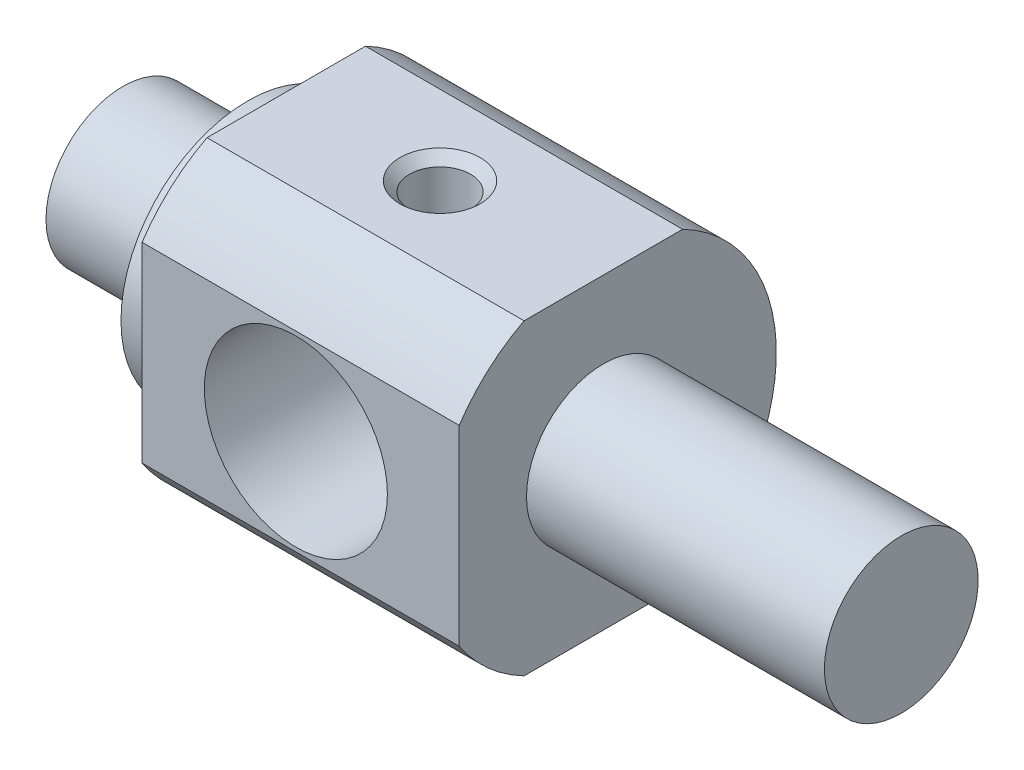
ISO-10303-21;
HEADER;
FILE_DESCRIPTION(('STEP AP214'),'2;1');
FILE_NAME('part.step','',(''),(''),'','','');
FILE_SCHEMA(('AUTOMOTIVE_DESIGN { 1 0 10303 214 1 1 1 1 }'));
ENDSEC;
DATA;
#1=APPLICATION_CONTEXT('core data for automotive mechanical design processes');
#2=APPLICATION_PROTOCOL_DEFINITION('international standard','automotive_design',2000,#1);
#3=PRODUCT_CONTEXT('',#1,'mechanical');
#4=PRODUCT('Part','Part','',(#3));
#5=PRODUCT_RELATED_PRODUCT_CATEGORY('part','',(#4));
#6=PRODUCT_DEFINITION_FORMATION('','',#4);
#7=PRODUCT_DEFINITION_CONTEXT('part definition',#1,'design');
#8=PRODUCT_DEFINITION('design','',#6,#7);
#9=PRODUCT_DEFINITION_SHAPE('','',#8);
#10=(LENGTH_UNIT() NAMED_UNIT(*) SI_UNIT(.MILLI.,.METRE.));
#11=(NAMED_UNIT(*) PLANE_ANGLE_UNIT() SI_UNIT($,.RADIAN.));
#12=(NAMED_UNIT(*) SI_UNIT($,.STERADIAN.) SOLID_ANGLE_UNIT());
#13=UNCERTAINTY_MEASURE_WITH_UNIT(LENGTH_MEASURE(1.E-05),#10,'distance_accuracy_value','');
#14=(GEOMETRIC_REPRESENTATION_CONTEXT(3) GLOBAL_UNCERTAINTY_ASSIGNED_CONTEXT((#13)) GLOBAL_UNIT_ASSIGNED_CONTEXT((#10,
#11,#12)) REPRESENTATION_CONTEXT('',''));
#15=CARTESIAN_POINT('',(0.,0.,0.));
#16=DIRECTION('',(0.,0.,1.));
#17=DIRECTION('',(1.,0.,0.));
#18=AXIS2_PLACEMENT_3D('',#15,#16,#17);
#19=CARTESIAN_POINT('',(-8.,0.,-0.75));
#20=DIRECTION('',(-1.,0.,0.));
#21=DIRECTION('',(0.,0.,1.));
#22=AXIS2_PLACEMENT_3D('',#19,#20,#21);
#23=PLANE('',#22);
#24=CARTESIAN_POINT('',(-8.,0.,0.));
#25=DIRECTION('',(-1.,0.,0.));
#26=DIRECTION('',(0.,0.,1.));
#27=AXIS2_PLACEMENT_3D('',#24,#25,#26);
#28=CIRCLE('',#27,6.6);
#29=CARTESIAN_POINT('',(-8.,0.,6.6));
#30=VERTEX_POINT('',#29);
#31=EDGE_CURVE('E262',#30,#30,#28,.T.);
#32=ORIENTED_EDGE('',*,*,#31,.F.);
#33=EDGE_LOOP('',(#32));
#34=FACE_BOUND('',#33,.T.);
#35=CARTESIAN_POINT('',(-8.,0.,0.));
#36=DIRECTION('',(-1.,0.,0.));
#37=DIRECTION('',(0.,0.,1.));
#38=AXIS2_PLACEMENT_3D('',#35,#36,#37);
#39=CIRCLE('',#38,9.);
#40=CARTESIAN_POINT('',(-8.,8.,-4.12310562561766));
#41=VERTEX_POINT('',#40);
#42=CARTESIAN_POINT('',(-8.,-8.,-4.12310562561766));
#43=VERTEX_POINT('',#42);
#44=EDGE_CURVE('E234',#41,#43,#39,.T.);
#45=ORIENTED_EDGE('',*,*,#44,.T.);
#46=DIRECTION('',(0.,0.,1.));
#47=VECTOR('',#46,1.);
#48=CARTESIAN_POINT('',(-8.,-8.,-0.75));
#49=LINE('',#48,#47);
#50=CARTESIAN_POINT('',(-8.,-8.,4.12310562561766));
#51=VERTEX_POINT('',#50);
#52=EDGE_CURVE('E59',#43,#51,#49,.T.);
#53=ORIENTED_EDGE('',*,*,#52,.T.);
#54=CARTESIAN_POINT('',(-8.,-4.9749371855331,7.5));
#55=VERTEX_POINT('',#54);
#56=EDGE_CURVE('E236',#51,#55,#39,.T.);
#57=ORIENTED_EDGE('',*,*,#56,.T.);
#58=DIRECTION('',(0.,-1.,0.));
#59=VECTOR('',#58,1.);
#60=CARTESIAN_POINT('',(-8.,0.,7.5));
#61=LINE('',#60,#59);
#62=CARTESIAN_POINT('',(-8.,4.9749371855331,7.5));
#63=VERTEX_POINT('',#62);
#64=EDGE_CURVE('E130',#63,#55,#61,.T.);
#65=ORIENTED_EDGE('',*,*,#64,.F.);
#66=CARTESIAN_POINT('',(-8.,8.,4.12310562561766));
#67=VERTEX_POINT('',#66);
#68=EDGE_CURVE('E229',#63,#67,#39,.T.);
#69=ORIENTED_EDGE('',*,*,#68,.T.);
#70=DIRECTION('',(0.,0.,-1.));
#71=VECTOR('',#70,1.);
#72=CARTESIAN_POINT('',(-8.,8.,-0.75));
#73=LINE('',#72,#71);
#74=EDGE_CURVE('E67',#67,#41,#73,.T.);
#75=ORIENTED_EDGE('',*,*,#74,.T.);
#76=EDGE_LOOP('',(#45,#53,#57,#65,#69,#75));
#77=FACE_BOUND('',#76,.T.);
#78=ADVANCED_FACE('F43',(#34,#77),#23,.T.);
#79=CARTESIAN_POINT('',(8.5,0.,-4.));
#80=DIRECTION('',(-1.,0.,0.));
#81=DIRECTION('',(0.,0.,1.));
#82=AXIS2_PLACEMENT_3D('',#79,#80,#81);
#83=PLANE('',#82);
#84=CARTESIAN_POINT('',(8.5,0.,0.));
#85=DIRECTION('',(-1.,0.,0.));
#86=DIRECTION('',(0.,0.,1.));
#87=AXIS2_PLACEMENT_3D('',#84,#85,#86);
#88=CIRCLE('',#87,4.);
#89=CARTESIAN_POINT('',(8.5,0.,4.));
#90=VERTEX_POINT('',#89);
#91=EDGE_CURVE('E120',#90,#90,#88,.T.);
#92=ORIENTED_EDGE('',*,*,#91,.T.);
#93=EDGE_LOOP('',(#92));
#94=FACE_BOUND('',#93,.T.);
#95=DIRECTION('',(0.,0.,1.));
#96=VECTOR('',#95,1.);
#97=CARTESIAN_POINT('',(8.5,-8.,-4.));
#98=LINE('',#97,#96);
#99=CARTESIAN_POINT('',(8.5,-8.,-4.12310562561766));
#100=VERTEX_POINT('',#99);
#101=CARTESIAN_POINT('',(8.5,-8.,4.12310562561766));
#102=VERTEX_POINT('',#101);
#103=EDGE_CURVE('E97',#100,#102,#98,.T.);
#104=ORIENTED_EDGE('',*,*,#103,.F.);
#105=CARTESIAN_POINT('',(8.5,0.,0.));
#106=DIRECTION('',(-1.,0.,0.));
#107=DIRECTION('',(0.,0.,1.));
#108=AXIS2_PLACEMENT_3D('',#105,#106,#107);
#109=CIRCLE('',#108,9.);
#110=CARTESIAN_POINT('',(8.5,8.,-4.12310562561766));
#111=VERTEX_POINT('',#110);
#112=EDGE_CURVE('E110',#111,#100,#109,.T.);
#113=ORIENTED_EDGE('',*,*,#112,.F.);
#114=DIRECTION('',(0.,0.,-1.));
#115=VECTOR('',#114,1.);
#116=CARTESIAN_POINT('',(8.5,8.,-4.));
#117=LINE('',#116,#115);
#118=CARTESIAN_POINT('',(8.5,8.,4.12310562561766));
#119=VERTEX_POINT('',#118);
#120=EDGE_CURVE('E287',#119,#111,#117,.T.);
#121=ORIENTED_EDGE('',*,*,#120,.F.);
#122=CARTESIAN_POINT('',(8.5,4.9749371855331,7.5));
#123=VERTEX_POINT('',#122);
#124=EDGE_CURVE('E117',#123,#119,#109,.T.);
#125=ORIENTED_EDGE('',*,*,#124,.F.);
#126=DIRECTION('',(0.,1.,0.));
#127=VECTOR('',#126,1.);
#128=CARTESIAN_POINT('',(8.5,0.,7.5));
#129=LINE('',#128,#127);
#130=CARTESIAN_POINT('',(8.5,-4.9749371855331,7.5));
#131=VERTEX_POINT('',#130);
#132=EDGE_CURVE('E241',#131,#123,#129,.T.);
#133=ORIENTED_EDGE('',*,*,#132,.F.);
#134=EDGE_CURVE('E112',#102,#131,#109,.T.);
#135=ORIENTED_EDGE('',*,*,#134,.F.);
#136=EDGE_LOOP('',(#104,#113,#121,#125,#133,#135));
#137=FACE_BOUND('',#136,.T.);
#138=ADVANCED_FACE('F108',(#94,#137),#83,.F.);
#139=CARTESIAN_POINT('',(-16.5,0.,0.));
#140=DIRECTION('',(-1.,0.,0.));
#141=DIRECTION('',(0.,0.,1.));
#142=AXIS2_PLACEMENT_3D('',#139,#140,#141);
#143=CYLINDRICAL_SURFACE('',#142,9.);
#144=DIRECTION('',(-1.,0.,0.));
#145=VECTOR('',#144,1.);
#146=CARTESIAN_POINT('',(-16.5,-8.,4.12310562561766));
#147=LINE('',#146,#145);
#148=EDGE_CURVE('E178',#102,#51,#147,.T.);
#149=ORIENTED_EDGE('',*,*,#148,.F.);
#150=ORIENTED_EDGE('',*,*,#134,.T.);
#151=DIRECTION('',(-1.,0.,0.));
#152=VECTOR('',#151,1.);
#153=CARTESIAN_POINT('',(-16.5,-4.9749371855331,7.5));
#154=LINE('',#153,#152);
#155=EDGE_CURVE('E231',#55,#131,#154,.F.);
#156=ORIENTED_EDGE('',*,*,#155,.F.);
#157=ORIENTED_EDGE('',*,*,#56,.F.);
#158=EDGE_LOOP('',(#149,#150,#156,#157));
#159=FACE_BOUND('',#158,.T.);
#160=ADVANCED_FACE('F205',(#159),#143,.T.);
#161=CARTESIAN_POINT('',(4.7625,0.,-9.));
#162=CARTESIAN_POINT('',(4.76250040344034,0.124347530609337,-9.00000033593268));
#163=CARTESIAN_POINT('',(4.75762497102388,0.248690209153137,-8.99741747917679));
#164=CARTESIAN_POINT('',(4.73818429685444,0.496448267490568,-8.98715281459778));
#165=CARTESIAN_POINT('',(4.72361561012522,0.619863301824312,-8.97946919396871));
#166=CARTESIAN_POINT('',(4.68494604518612,0.864923756681962,-8.95918759669115));
#167=CARTESIAN_POINT('',(4.66083414342587,0.98656696145733,-8.9465839370429));
#168=CARTESIAN_POINT('',(4.60335659926926,1.2271165949106,-8.91677535279601));
#169=CARTESIAN_POINT('',(4.56998717551858,1.34602188371177,-8.89956854808615));
#170=CARTESIAN_POINT('',(4.49453183223207,1.57974647578819,-8.86105868833504));
#171=CARTESIAN_POINT('',(4.45248572241949,1.69458172797125,-8.8397743723139));
#172=CARTESIAN_POINT('',(4.35999791893359,1.9200769121018,-8.79355324714562));
#173=CARTESIAN_POINT('',(4.30955305630161,2.03073524863851,-8.76861505977304));
#174=CARTESIAN_POINT('',(4.14631195388206,2.355441383801,-8.689154350124));
#175=CARTESIAN_POINT('',(4.02153101438027,2.56245973522728,-8.62994450585192));
#176=CARTESIAN_POINT('',(3.73450769966515,2.96653161712556,-8.49986717483721));
#177=CARTESIAN_POINT('',(3.57034891314541,3.16204774981258,-8.42849050207323));
#178=CARTESIAN_POINT('',(3.21341021284217,3.52422455016379,-8.28359383226396));
#179=CARTESIAN_POINT('',(3.02060591709596,3.69086037164852,-8.21007205265056));
#180=CARTESIAN_POINT('',(2.59104583087089,4.00559873450946,-8.06152102346557));
#181=CARTESIAN_POINT('',(2.35190146425856,4.15071118989951,-7.98694495512679));
#182=CARTESIAN_POINT('',(1.97456817015392,4.33614928006894,-7.88687285646168));
#183=CARTESIAN_POINT('',(1.84564222134866,4.39260344965641,-7.85547245236333));
#184=CARTESIAN_POINT('',(1.5823191366162,4.49416795346155,-7.79781135767696));
#185=CARTESIAN_POINT('',(1.44792547419633,4.5392853628367,-7.77154746372517));
#186=CARTESIAN_POINT('',(1.1830798050455,4.61514045974754,-7.72672647724666));
#187=CARTESIAN_POINT('',(1.05289599580195,4.64659346275591,-7.70779393806304));
#188=CARTESIAN_POINT('',(0.789657110491455,4.69849204058019,-7.67626849509927));
#189=CARTESIAN_POINT('',(0.65660369525027,4.71894381365446,-7.66367202174455));
#190=CARTESIAN_POINT('',(0.388873670643937,4.74850579482423,-7.64539058531394));
#191=CARTESIAN_POINT('',(0.254198429728474,4.75762496903582,-7.63970015840158));
#192=CARTESIAN_POINT('',(-0.0155431786148998,4.76438472807634,-7.63548662756686));
#193=CARTESIAN_POINT('',(-0.1506094981826,4.76202666269402,-7.63696268082556));
#194=CARTESIAN_POINT('',(-0.401152716936114,4.7469969845373,-7.64631160227324));
#195=CARTESIAN_POINT('',(-0.516754986564765,4.73579711408422,-7.65327138720916));
#196=CARTESIAN_POINT('',(-0.746443468906819,4.70506908950683,-7.67219908924904));
#197=CARTESIAN_POINT('',(-0.860529202601121,4.68553836552996,-7.68416855168734));
#198=CARTESIAN_POINT('',(-1.19933778505102,4.61477120774495,-7.72703163704495));
#199=CARTESIAN_POINT('',(-1.42076628999166,4.55135015439165,-7.76488652808671));
#200=CARTESIAN_POINT('',(-1.85436132832839,4.39287685995124,-7.85563852081105));
#201=CARTESIAN_POINT('',(-2.06620473013008,4.29714108141298,-7.9088567355142));
#202=CARTESIAN_POINT('',(-2.47192313766677,4.0772854937053,-8.02440970702211));
#203=CARTESIAN_POINT('',(-2.66579009227439,3.95315305196382,-8.08674851676314));
#204=CARTESIAN_POINT('',(-3.05943768140512,3.65923791181625,-8.22435127572942));
#205=CARTESIAN_POINT('',(-3.25603446809802,3.48545254953575,-8.30018223292903));
#206=CARTESIAN_POINT('',(-3.61878837512707,3.10715207855429,-8.44907339742118));
#207=CARTESIAN_POINT('',(-3.78492745789656,2.90261889011612,-8.52213194266733));
#208=CARTESIAN_POINT('',(-4.01229420738898,2.56951895440973,-8.62625299951984));
#209=CARTESIAN_POINT('',(-4.08610651228028,2.45048287630086,-8.66090273193149));
#210=CARTESIAN_POINT('',(-4.2233184790146,2.20559716317462,-8.72647541123955));
#211=CARTESIAN_POINT('',(-4.28672257017004,2.07975045695929,-8.75739994193113));
#212=CARTESIAN_POINT('',(-4.4024166722361,1.82210605452825,-8.81460949891191));
#213=CARTESIAN_POINT('',(-4.45471182057732,1.69031114345429,-8.84089666883255));
#214=CARTESIAN_POINT('',(-4.54756346992604,1.4217082325301,-8.88804394832803));
#215=CARTESIAN_POINT('',(-4.58812150455471,1.28490089025961,-8.90890476689695));
#216=CARTESIAN_POINT('',(-4.65385418760969,1.01980548149451,-8.94294338288788));
#217=CARTESIAN_POINT('',(-4.68007688556574,0.891843215793048,-8.9566398222332));
#218=CARTESIAN_POINT('',(-4.72195515273394,0.633744720642586,-8.97859314111829));
#219=CARTESIAN_POINT('',(-4.73761181149047,0.503608716762799,-8.98685058151237));
#220=CARTESIAN_POINT('',(-4.75813604512215,0.242311954478257,-8.99768728747259));
#221=CARTESIAN_POINT('',(-4.76300848266171,0.111151684704635,-9.00026911220135));
#222=CARTESIAN_POINT('',(-4.76190771489409,-0.15110703256956,-8.99968654248137));
#223=CARTESIAN_POINT('',(-4.75593511011223,-0.282205483091189,-8.99652246620188));
#224=CARTESIAN_POINT('',(-4.73424855064391,-0.531535942882391,-8.98507811945353));
#225=CARTESIAN_POINT('',(-4.71945222443262,-0.649871386958457,-8.97728000824626));
#226=CARTESIAN_POINT('',(-4.68110736184933,-0.884763575078478,-8.95718110814576));
#227=CARTESIAN_POINT('',(-4.65755608471691,-1.00131975020947,-8.9448789092543));
#228=CARTESIAN_POINT('',(-4.60196425659837,-1.23181886042372,-8.91605869083801));
#229=CARTESIAN_POINT('',(-4.56992636841199,-1.34576260303282,-8.89954199373392));
#230=CARTESIAN_POINT('',(-4.49768482213555,-1.57040822753636,-8.86266360437937));
#231=CARTESIAN_POINT('',(-4.45747801634521,-1.68110884089638,-8.84230043019264));
#232=CARTESIAN_POINT('',(-4.32291680123585,-2.01285493333985,-8.77496475562326));
#233=CARTESIAN_POINT('',(-4.21600277364841,-2.22784676260846,-8.72248545363852));
#234=CARTESIAN_POINT('',(-3.97273258849654,-2.63736014731493,-8.60753941243389));
#235=CARTESIAN_POINT('',(-3.83636477814371,-2.83187355544841,-8.54506872287111));
#236=CARTESIAN_POINT('',(-3.52137960502942,-3.21708140633032,-8.40811866059607));
#237=CARTESIAN_POINT('',(-3.33980863724168,-3.40516035248391,-8.33306899481405));
#238=CARTESIAN_POINT('',(-2.94791523306578,-3.74956909780719,-8.18388734030329));
#239=CARTESIAN_POINT('',(-2.73756728995106,-3.90587042157548,-8.10975623003755));
#240=CARTESIAN_POINT('',(-2.39626688930486,-4.11811375214691,-8.00299868949882));
#241=CARTESIAN_POINT('',(-2.27410215022463,-4.18683953100871,-7.96715458296367));
#242=CARTESIAN_POINT('',(-2.02336685114954,-4.31359488157598,-7.89924434073457));
#243=CARTESIAN_POINT('',(-1.8947994215147,-4.37162961630491,-7.86717638413926));
#244=CARTESIAN_POINT('',(-1.6321305650715,-4.47633002878034,-7.80807832339694));
#245=CARTESIAN_POINT('',(-1.49803418007951,-4.52300580779348,-7.7810437482403));
#246=CARTESIAN_POINT('',(-1.22518750903089,-4.6044083186877,-7.73315334237041));
#247=CARTESIAN_POINT('',(-1.08643804422795,-4.6391371471125,-7.71229642764267));
#248=CARTESIAN_POINT('',(-0.819273916993452,-4.69328392273565,-7.67945226514975));
#249=CARTESIAN_POINT('',(-0.691177302945137,-4.71386794672929,-7.66679657998025));
#250=CARTESIAN_POINT('',(-0.433271103101365,-4.74452730742417,-7.64786173290068));
#251=CARTESIAN_POINT('',(-0.303461750092644,-4.75460405762069,-7.64158171330458));
#252=CARTESIAN_POINT('',(-0.0433694510382342,-4.76407931361045,-7.63567808280728));
#253=CARTESIAN_POINT('',(0.0869132157401269,-4.76348333250254,-7.63605103525096));
#254=CARTESIAN_POINT('',(0.34679655585983,-4.75163730961809,-7.64342798657303));
#255=CARTESIAN_POINT('',(0.476397271138804,-4.74038793087339,-7.65043157278294));
#256=CARTESIAN_POINT('',(0.718496074448173,-4.70937876393872,-7.66955263472613));
#257=CARTESIAN_POINT('',(0.83120151623908,-4.69078495106566,-7.6809660561983));
#258=CARTESIAN_POINT('',(1.05447229830989,-4.64569507486617,-7.70832050051003));
#259=CARTESIAN_POINT('',(1.16503697948606,-4.61919661777295,-7.72426289479052));
#260=CARTESIAN_POINT('',(1.49251447862105,-4.52825029307427,-7.77817276738403));
#261=CARTESIAN_POINT('',(1.70535271444985,-4.45233287959253,-7.82223512012185));
#262=CARTESIAN_POINT('',(2.12915698663366,-4.26674886059048,-7.92507095583544));
#263=CARTESIAN_POINT('',(2.33910172027825,-4.15520901106104,-7.98461461078299));
#264=CARTESIAN_POINT('',(2.73873560413043,-3.9034008640743,-8.11068926544477));
#265=CARTESIAN_POINT('',(2.92841376260295,-3.76311709625537,-8.17722401842726));
#266=CARTESIAN_POINT('',(3.3100914927705,-3.43464615735664,-8.32104145757807));
#267=CARTESIAN_POINT('',(3.49861356527532,-3.24248814667078,-8.3985115102675));
#268=CARTESIAN_POINT('',(3.84182536349103,-2.82740321822199,-8.54717875720498));
#269=CARTESIAN_POINT('',(3.99649372834455,-2.60445701771309,-8.61837197410443));
#270=CARTESIAN_POINT('',(4.20079827858228,-2.24812566848557,-8.71559793731253));
#271=CARTESIAN_POINT('',(4.26483700274428,-2.12418324985102,-8.74670425907457));
#272=CARTESIAN_POINT('',(4.38210340700569,-1.87031879401267,-8.80447671148234));
#273=CARTESIAN_POINT('',(4.43533641009264,-1.74039973982838,-8.83114502715428));
#274=CARTESIAN_POINT('',(4.53025646437553,-1.47577336946772,-8.87919744770186));
#275=CARTESIAN_POINT('',(4.57196701465996,-1.34107644039356,-8.90059229762171));
#276=CARTESIAN_POINT('',(4.64339305083211,-1.06781622605154,-8.93749157200341));
#277=CARTESIAN_POINT('',(4.673115276126,-0.92925516003718,-8.95299930570159));
#278=CARTESIAN_POINT('',(4.71847947813409,-0.659351879404655,-8.97676434810901));
#279=CARTESIAN_POINT('',(4.73496634992829,-0.528189374616844,-8.98545571626096));
#280=CARTESIAN_POINT('',(4.75697648476616,-0.26468276068211,-8.99707341002876));
#281=CARTESIAN_POINT('',(4.76249957063286,-0.132338632474631,-8.99999964247885));
#282=CARTESIAN_POINT('',(4.7625,0.,-9.));
#283=B_SPLINE_CURVE_WITH_KNOTS('',3,(#161,#162,#163,#164,#165,#166,#167,#168,#169,#170,#171,
#172,#173,#174,#175,#176,#177,#178,#179,#180,#181,#182,#183,#184,#185,#186,#187,#188,#189,#190,
#191,#192,#193,#194,#195,#196,#197,#198,#199,#200,#201,#202,#203,#204,#205,#206,#207,#208,#209,
#210,#211,#212,#213,#214,#215,#216,#217,#218,#219,#220,#221,#222,#223,#224,#225,#226,#227,#228,
#229,#230,#231,#232,#233,#234,#235,#236,#237,#238,#239,#240,#241,#242,#243,#244,#245,#246,#247,
#248,#249,#250,#251,#252,#253,#254,#255,#256,#257,#258,#259,#260,#261,#262,#263,#264,#265,#266,
#267,#268,#269,#270,#271,#272,#273,#274,#275,#276,#277,#278,#279,#280,#281,#282),.UNSPECIFIED.,
.T.,.F.,(4,2,2,2,2,2,2,2,2,2,2,2,2,2,2,2,2,2,2,2,2,2,2,2,2,2,2,2,2,2,2,2,2,2,2,2,2,2,2,2,2,2,2,
2,2,2,2,2,2,2,2,2,2,2,2,2,2,2,2,2,4),(0.,0.372912735375715,0.745958074537272,1.11943558906099,
1.49306588047298,1.86501857493255,2.23711193135867,2.98054173945517,3.77259683168748,
4.56532999470477,5.42895642000663,5.86105348503776,6.29288020910701,6.69807088525076,
7.10303303112271,7.50767457497925,7.91226853183547,8.26089695162553,8.60963299211596,
9.30664673976379,10.0194388201854,10.7325486128775,11.5485658366515,12.365064769404,
12.7974337802674,13.2296183127742,13.6616025404303,14.0935302976789,14.4870065185386,
14.8804421588801,15.2737003607644,15.666936787325,16.0250536553686,16.3832827273805,
16.7413995325868,17.0996545922854,17.8336908431551,18.5680180341853,19.3805925575267,
20.1938920370063,20.6274443207353,21.0607866771151,21.4937422519301,21.9266218095311,
22.3171226184695,22.7075708883476,23.097817474352,23.4880397743099,23.8320373095211,
24.1761391235887,24.8639166558257,25.5964082992801,26.3292952200101,27.1660025255825,
28.0032362606288,28.431539090943,28.8596304209725,29.2868421381476,29.7138133563692,
30.1106846387448,30.5075623345878),.UNSPECIFIED.);
#284=CARTESIAN_POINT('',(4.7625,0.,-9.));
#285=VERTEX_POINT('',#284);
#286=EDGE_CURVE('E142',#285,#285,#283,.T.);
#287=ORIENTED_EDGE('',*,*,#286,.T.);
#288=EDGE_LOOP('',(#287));
#289=FACE_BOUND('',#288,.T.);
#290=DIRECTION('',(-1.,0.,0.));
#291=VECTOR('',#290,1.);
#292=CARTESIAN_POINT('',(-16.5,-8.,-4.12310562561766));
#293=LINE('',#292,#291);
#294=EDGE_CURVE('E94',#43,#100,#293,.F.);
#295=ORIENTED_EDGE('',*,*,#294,.F.);
#296=ORIENTED_EDGE('',*,*,#44,.F.);
#297=DIRECTION('',(-1.,0.,0.));
#298=VECTOR('',#297,1.);
#299=CARTESIAN_POINT('',(-16.5,8.,-4.12310562561766));
#300=LINE('',#299,#298);
#301=EDGE_CURVE('E116',#111,#41,#300,.T.);
#302=ORIENTED_EDGE('',*,*,#301,.F.);
#303=ORIENTED_EDGE('',*,*,#112,.T.);
#304=EDGE_LOOP('',(#295,#296,#302,#303));
#305=FACE_BOUND('',#304,.T.);
#306=ADVANCED_FACE('F115',(#289,#305),#143,.T.);
#307=CARTESIAN_POINT('',(0.,8.,0.));
#308=DIRECTION('',(0.,1.,0.));
#309=DIRECTION('',(0.,0.,1.));
#310=AXIS2_PLACEMENT_3D('',#307,#308,#309);
#311=CYLINDRICAL_SURFACE('',#310,1.5875);
#312=CARTESIAN_POINT('',(0.,-4.7625,1.5875));
#313=CARTESIAN_POINT('',(-0.0866193385826729,-4.76250024290248,1.58750040279898));
#314=CARTESIAN_POINT('',(-0.173236246329948,-4.76011509093227,1.58038757752304));
#315=CARTESIAN_POINT('',(-0.343918795385843,-4.75083521197708,1.55221128975266));
#316=CARTESIAN_POINT('',(-0.427984170888622,-4.74394001683417,1.53114637898108));
#317=CARTESIAN_POINT('',(-0.591078303334068,-4.72638926301477,1.47586820112782));
#318=CARTESIAN_POINT('',(-0.670115223594078,-4.71573999272729,1.4416769133459));
#319=CARTESIAN_POINT('',(-0.821332712178451,-4.6917680757628,1.36121588811912));
#320=CARTESIAN_POINT('',(-0.893511924171944,-4.67844490185097,1.31494376805837));
#321=CARTESIAN_POINT('',(-1.03146490909785,-4.6500112492827,1.20995153478673));
#322=CARTESIAN_POINT('',(-1.09696837422356,-4.63485795886258,1.15088791561146));
#323=CARTESIAN_POINT('',(-1.21734689966456,-4.60470749718205,1.02271964190332));
#324=CARTESIAN_POINT('',(-1.27221961946452,-4.58971036098746,0.953612782050985));
#325=CARTESIAN_POINT('',(-1.37132209578672,-4.56109915307672,0.804886129625619));
#326=CARTESIAN_POINT('',(-1.41520046242589,-4.54753724850155,0.725021188175255));
#327=CARTESIAN_POINT('',(-1.48878746228088,-4.52398297352029,0.558520450047056));
#328=CARTESIAN_POINT('',(-1.51850041960149,-4.51398951405183,0.471886729004144));
#329=CARTESIAN_POINT('',(-1.56189912014579,-4.49915443940136,0.297381260873972));
#330=CARTESIAN_POINT('',(-1.57609134913143,-4.49415052034258,0.20964968152361));
#331=CARTESIAN_POINT('',(-1.58962903329348,-4.48938104899343,0.0329187902775394));
#332=CARTESIAN_POINT('',(-1.58897907629749,-4.48961387798584,-0.0560801213758395));
#333=CARTESIAN_POINT('',(-1.57324409712917,-4.49514936325486,-0.228499400829883));
#334=CARTESIAN_POINT('',(-1.5588200871526,-4.50021985189708,-0.311988839633941));
#335=CARTESIAN_POINT('',(-1.51702478352345,-4.51447944137724,-0.475287053625849));
#336=CARTESIAN_POINT('',(-1.48965193971459,-4.52366903532271,-0.555095386878173));
#337=CARTESIAN_POINT('',(-1.42230325467058,-4.54529683920857,-0.710267739976471));
#338=CARTESIAN_POINT('',(-1.38213155232278,-4.55778498196574,-0.785539490432871));
#339=CARTESIAN_POINT('',(-1.29046145625623,-4.58458186738965,-0.928482566894064));
#340=CARTESIAN_POINT('',(-1.23895979087786,-4.59889113542361,-0.996151689006741));
#341=CARTESIAN_POINT('',(-1.12291706563305,-4.62863135053788,-1.12568291208022));
#342=CARTESIAN_POINT('',(-1.05783562574614,-4.64408185600813,-1.18705740253315));
#343=CARTESIAN_POINT('',(-0.918114067327474,-4.67371014689421,-1.29814838582814));
#344=CARTESIAN_POINT('',(-0.843473033111541,-4.68788781016682,-1.34786376058613));
#345=CARTESIAN_POINT('',(-0.685716835710948,-4.71355908851247,-1.43461787662317));
#346=CARTESIAN_POINT('',(-0.602524951310933,-4.72502468137762,-1.47152596750341));
#347=CARTESIAN_POINT('',(-0.430639669841155,-4.7437765034179,-1.53067253865469));
#348=CARTESIAN_POINT('',(-0.341948195570988,-4.7510641842712,-1.5529161147347));
#349=CARTESIAN_POINT('',(-0.16570932937777,-4.76039857975911,-1.58123836981049));
#350=CARTESIAN_POINT('',(-0.078278989785443,-4.76265877911043,-1.58797594706174));
#351=CARTESIAN_POINT('',(0.0964804235618768,-4.76232383028038,-1.58697188066243));
#352=CARTESIAN_POINT('',(0.183809511919945,-4.75972950165737,-1.57923268103194));
#353=CARTESIAN_POINT('',(0.353250287758005,-4.75011789238403,-1.55001609646916));
#354=CARTESIAN_POINT('',(0.435439830850313,-4.74323090454018,-1.52894314789643));
#355=CARTESIAN_POINT('',(0.595083834245072,-4.72585806842736,-1.47416290690907));
#356=CARTESIAN_POINT('',(0.672537689257411,-4.71537176124096,-1.44045400334489));
#357=CARTESIAN_POINT('',(0.82278267052432,-4.69152178418572,-1.36037568945275));
#358=CARTESIAN_POINT('',(0.895397560257219,-4.6780896842481,-1.31369658316296));
#359=CARTESIAN_POINT('',(1.03197791784024,-4.64987090592066,-1.20936678685359));
#360=CARTESIAN_POINT('',(1.09594073387548,-4.63508381455201,-1.15171274604957));
#361=CARTESIAN_POINT('',(1.2164258561425,-4.60496996168956,-1.02397123277704));
#362=CARTESIAN_POINT('',(1.27247803867766,-4.58964920726292,-0.953437852253606));
#363=CARTESIAN_POINT('',(1.37200881668867,-4.5608870760535,-0.803637636100214));
#364=CARTESIAN_POINT('',(1.41548730734048,-4.54744571493928,-0.724370727668402));
#365=CARTESIAN_POINT('',(1.48843512703597,-4.52409546968821,-0.559319088227289));
#366=CARTESIAN_POINT('',(1.51793278481197,-4.51417945258854,-0.473547949319583));
#367=CARTESIAN_POINT('',(1.56193278348047,-4.49914696286488,-0.297848893054942));
#368=CARTESIAN_POINT('',(1.57644187973938,-4.49402832815027,-0.207922867420594));
#369=CARTESIAN_POINT('',(1.58952609843278,-4.48941600962756,-0.0314371100350451));
#370=CARTESIAN_POINT('',(1.58888153347708,-4.48964685408646,0.055058215205332));
#371=CARTESIAN_POINT('',(1.5735971408498,-4.49502640845389,0.226639556438774));
#372=CARTESIAN_POINT('',(1.5589581461405,-4.50017482566361,0.311725656003703));
#373=CARTESIAN_POINT('',(1.51665275334283,-4.51460432334015,0.476465365016424));
#374=CARTESIAN_POINT('',(1.48923906179963,-4.52380505610683,0.556191459694638));
#375=CARTESIAN_POINT('',(1.42236724314359,-4.54527283124319,0.709973508514501));
#376=CARTESIAN_POINT('',(1.38290644257916,-4.55754055411886,0.78402819951096));
#377=CARTESIAN_POINT('',(1.29105134947619,-4.58442741396348,0.92786782600262));
#378=CARTESIAN_POINT('',(1.23816783538877,-4.59912579731892,0.997325446763686));
#379=CARTESIAN_POINT('',(1.12179557697784,-4.62888578099664,1.12663257874742));
#380=CARTESIAN_POINT('',(1.05830383406672,-4.64394748298391,1.18647936390482));
#381=CARTESIAN_POINT('',(0.91954597161159,-4.67344173459301,1.29721675450907));
#382=CARTESIAN_POINT('',(0.843917402680817,-4.68782688609495,1.34766740205471));
#383=CARTESIAN_POINT('',(0.684779804883015,-4.71370010986521,1.4350848058004));
#384=CARTESIAN_POINT('',(0.601272797535102,-4.72518892253838,1.47205500915124));
#385=CARTESIAN_POINT('',(0.432583664931548,-4.7435375517131,1.52990809157576));
#386=CARTESIAN_POINT('',(0.347643065311298,-4.75058124720754,1.55143591519311));
#387=CARTESIAN_POINT('',(0.175133660416267,-4.76006171214452,1.58022969557493));
#388=CARTESIAN_POINT('',(0.0875655880903847,-4.76249975444399,1.58749959280075));
#389=CARTESIAN_POINT('',(0.,-4.7625,1.5875));
#390=B_SPLINE_CURVE_WITH_KNOTS('',3,(#312,#313,#314,#315,#316,#317,#318,#319,#320,#321,#322,
#323,#324,#325,#326,#327,#328,#329,#330,#331,#332,#333,#334,#335,#336,#337,#338,#339,#340,#341,
#342,#343,#344,#345,#346,#347,#348,#349,#350,#351,#352,#353,#354,#355,#356,#357,#358,#359,#360,
#361,#362,#363,#364,#365,#366,#367,#368,#369,#370,#371,#372,#373,#374,#375,#376,#377,#378,#379,
#380,#381,#382,#383,#384,#385,#386,#387,#388,#389),.UNSPECIFIED.,.T.,.F.,(4,2,2,2,2,2,2,2,2,2,2,
2,2,2,2,2,2,2,2,2,2,2,2,2,2,2,2,2,2,2,2,2,2,2,2,2,2,2,4),(0.,0.259535780816292,
0.519098506612188,0.778228493181558,1.03740962475607,1.30468186298875,1.57201287843954,
1.84703060907259,2.12196433449872,2.38763057115171,2.65321468955133,2.90666212150157,
3.16013990233077,3.41769971708769,3.67533400311153,3.94641872975544,4.21752944222006,
4.49132968969942,4.76503474342567,5.02687563290581,5.28867232148129,5.54288575790413,
5.79713161888514,6.05806509751931,6.31907837054751,6.59195123823192,6.86482638073056,
7.13714621949997,7.4093432697052,7.66755619877009,7.92575375970307,8.17904744490161,
8.43239738104363,8.69680230873238,8.96128210158997,9.2360696157572,9.51078681329523,
9.77323036418427,10.0356013733555),.UNSPECIFIED.);
#391=CARTESIAN_POINT('',(0.,-4.7625,1.5875));
#392=VERTEX_POINT('',#391);
#393=EDGE_CURVE('E177',#392,#392,#390,.T.);
#394=ORIENTED_EDGE('',*,*,#393,.F.);
#395=EDGE_LOOP('',(#394));
#396=FACE_BOUND('',#395,.T.);
#397=CARTESIAN_POINT('',(0.,-8.,0.));
#398=DIRECTION('',(0.,-1.,0.));
#399=DIRECTION('',(0.,0.,-1.));
#400=AXIS2_PLACEMENT_3D('',#397,#398,#399);
#401=CIRCLE('',#400,1.5875);
#402=CARTESIAN_POINT('',(0.,-8.,-1.5875));
#403=VERTEX_POINT('',#402);
#404=EDGE_CURVE('E103',#403,#403,#401,.F.);
#405=ORIENTED_EDGE('',*,*,#404,.F.);
#406=EDGE_LOOP('',(#405));
#407=FACE_BOUND('',#406,.T.);
#408=ADVANCED_FACE('F183',(#396,#407),#311,.F.);
#409=DIRECTION('',(-1.,0.,0.));
#410=VECTOR('',#409,1.);
#411=CARTESIAN_POINT('',(-16.5,8.,4.12310562561766));
#412=LINE('',#411,#410);
#413=EDGE_CURVE('E133',#67,#119,#412,.F.);
#414=ORIENTED_EDGE('',*,*,#413,.F.);
#415=ORIENTED_EDGE('',*,*,#68,.F.);
#416=DIRECTION('',(-1.,0.,0.));
#417=VECTOR('',#416,1.);
#418=CARTESIAN_POINT('',(-16.5,4.9749371855331,7.5));
#419=LINE('',#418,#417);
#420=EDGE_CURVE('E243',#123,#63,#419,.T.);
#421=ORIENTED_EDGE('',*,*,#420,.F.);
#422=ORIENTED_EDGE('',*,*,#124,.T.);
#423=EDGE_LOOP('',(#414,#415,#421,#422));
#424=FACE_BOUND('',#423,.T.);
#425=ADVANCED_FACE('F187',(#424),#143,.T.);
#426=CARTESIAN_POINT('',(-10.,0.,-9.));
#427=DIRECTION('',(1.,0.,0.));
#428=DIRECTION('',(0.,0.,-1.));
#429=AXIS2_PLACEMENT_3D('',#426,#427,#428);
#430=PLANE('',#429);
#431=CARTESIAN_POINT('',(-10.,0.,0.));
#432=DIRECTION('',(-1.,0.,0.));
#433=DIRECTION('',(0.,0.,1.));
#434=AXIS2_PLACEMENT_3D('',#431,#432,#433);
#435=CIRCLE('',#434,4.);
#436=CARTESIAN_POINT('',(-10.,0.,4.));
#437=VERTEX_POINT('',#436);
#438=EDGE_CURVE('E121',#437,#437,#435,.T.);
#439=ORIENTED_EDGE('',*,*,#438,.F.);
#440=EDGE_LOOP('',(#439));
#441=FACE_BOUND('',#440,.T.);
#442=CARTESIAN_POINT('',(-10.,0.,0.));
#443=DIRECTION('',(-1.,0.,0.));
#444=DIRECTION('',(0.,0.,1.));
#445=AXIS2_PLACEMENT_3D('',#442,#443,#444);
#446=CIRCLE('',#445,6.6);
#447=CARTESIAN_POINT('',(-10.,0.,6.6));
#448=VERTEX_POINT('',#447);
#449=EDGE_CURVE('E260',#448,#448,#446,.T.);
#450=ORIENTED_EDGE('',*,*,#449,.T.);
#451=EDGE_LOOP('',(#450));
#452=FACE_BOUND('',#451,.T.);
#453=ADVANCED_FACE('F253',(#441,#452),#430,.F.);
#454=CARTESIAN_POINT('',(-16.5,0.,-4.));
#455=DIRECTION('',(1.,0.,0.));
#456=DIRECTION('',(0.,0.,-1.));
#457=AXIS2_PLACEMENT_3D('',#454,#455,#456);
#458=PLANE('',#457);
#459=CARTESIAN_POINT('',(-16.5,0.,0.));
#460=DIRECTION('',(-1.,0.,0.));
#461=DIRECTION('',(0.,0.,1.));
#462=AXIS2_PLACEMENT_3D('',#459,#460,#461);
#463=CIRCLE('',#462,4.);
#464=CARTESIAN_POINT('',(-16.5,0.,4.));
#465=VERTEX_POINT('',#464);
#466=EDGE_CURVE('E245',#465,#465,#463,.T.);
#467=ORIENTED_EDGE('',*,*,#466,.T.);
#468=EDGE_LOOP('',(#467));
#469=FACE_BOUND('',#468,.T.);
#470=CARTESIAN_POINT('',(-16.5,0.,0.));
#471=DIRECTION('',(-1.,0.,0.));
#472=DIRECTION('',(0.,0.,1.));
#473=AXIS2_PLACEMENT_3D('',#470,#471,#472);
#474=CIRCLE('',#473,1.7272);
#475=CARTESIAN_POINT('',(-16.5,0.,1.7272));
#476=VERTEX_POINT('',#475);
#477=EDGE_CURVE('E227',#476,#476,#474,.T.);
#478=ORIENTED_EDGE('',*,*,#477,.F.);
#479=EDGE_LOOP('',(#478));
#480=FACE_BOUND('',#479,.T.);
#481=ADVANCED_FACE('F256',(#469,#480),#458,.F.);
#482=CARTESIAN_POINT('',(-16.5,0.,0.));
#483=DIRECTION('',(-1.,0.,0.));
#484=DIRECTION('',(0.,0.,1.));
#485=AXIS2_PLACEMENT_3D('',#482,#483,#484);
#486=CYLINDRICAL_SURFACE('',#485,4.);
#487=ORIENTED_EDGE('',*,*,#466,.F.);
#488=EDGE_LOOP('',(#487));
#489=FACE_BOUND('',#488,.T.);
#490=ORIENTED_EDGE('',*,*,#438,.T.);
#491=EDGE_LOOP('',(#490));
#492=FACE_BOUND('',#491,.T.);
#493=ADVANCED_FACE('F219',(#489,#492),#486,.T.);
#494=CARTESIAN_POINT('',(-5.79,0.,0.));
#495=DIRECTION('',(-1.,0.,0.));
#496=DIRECTION('',(0.,0.,1.));
#497=AXIS2_PLACEMENT_3D('',#494,#495,#496);
#498=CONICAL_SURFACE('',#497,1.7272,1.02974425867665);
#499=CARTESIAN_POINT('',(-4.76247741693726,-0.0146663957069357,-0.00882204789461912));
#500=CARTESIAN_POINT('',(-4.76247893900563,-0.0141721546465493,-0.0096485411905238));
#501=CARTESIAN_POINT('',(-4.76248060048711,-0.0136078396637135,-0.0104339415549042));
#502=CARTESIAN_POINT('',(-4.76248401567558,-0.0123548422312533,-0.01189945859676));
#503=CARTESIAN_POINT('',(-4.76248576948931,-0.0116660135121903,-0.0125794496832752));
#504=CARTESIAN_POINT('',(-4.76248916851895,-0.0101841659526936,-0.013813507319612));
#505=CARTESIAN_POINT('',(-4.76249081380425,-0.00939121465357078,-0.0143676548698818));
#506=CARTESIAN_POINT('',(-4.7624938101049,-0.0077235244550204,-0.0153343510418347));
#507=CARTESIAN_POINT('',(-4.76249516119518,-0.00684880645985682,-0.0157469357298197));
#508=CARTESIAN_POINT('',(-4.7624974131353,-0.0050448462056021,-0.016417824978434));
#509=CARTESIAN_POINT('',(-4.76249831522537,-0.00411576215120478,-0.0166765549089864));
#510=CARTESIAN_POINT('',(-4.76249957274606,-0.0022272765334139,-0.0170340260718423));
#511=CARTESIAN_POINT('',(-4.76249992816342,-0.00126787423428479,-0.0171327634185472));
#512=CARTESIAN_POINT('',(-4.7625000519226,0.000651944915263623,-0.0171673376162856));
#513=CARTESIAN_POINT('',(-4.7624998214304,0.00161235595480908,-0.0171034979989839));
#514=CARTESIAN_POINT('',(-4.76249880185758,0.00350881207781196,-0.0168154495868988));
#515=CARTESIAN_POINT('',(-4.76249801278016,0.00444485730030172,-0.0165912417073912));
#516=CARTESIAN_POINT('',(-4.76249596517724,0.00626587913497903,-0.0159889846263463));
#517=CARTESIAN_POINT('',(-4.76249470673509,0.00715086478105571,-0.0156109627347699));
#518=CARTESIAN_POINT('',(-4.76249186195406,0.00884495628245117,-0.014711950625154));
#519=CARTESIAN_POINT('',(-4.76249027561357,0.00965406176336549,-0.0141909597017329));
#520=CARTESIAN_POINT('',(-4.76248695022384,0.0111749393347839,-0.0130199237207816));
#521=CARTESIAN_POINT('',(-4.76248521092133,0.0118865448097564,-0.0123696622899185));
#522=CARTESIAN_POINT('',(-4.76248177714245,0.0131908612733591,-0.0109591976983726));
#523=CARTESIAN_POINT('',(-4.76248008266677,0.0137835704440058,-0.0101989928569063));
#524=CARTESIAN_POINT('',(-4.76247692379654,0.0148350431651258,-0.00858795175563163));
#525=CARTESIAN_POINT('',(-4.76247546005911,0.0152934272518246,-0.00773686783309376));
#526=CARTESIAN_POINT('',(-4.76247293268833,0.0160612454300078,-0.00596997329553233));
#527=CARTESIAN_POINT('',(-4.76247186906106,0.0163706772577205,-0.00505416169702221));
#528=CARTESIAN_POINT('',(-4.76247025890992,0.01683261821569,-0.00318117116363141));
#529=CARTESIAN_POINT('',(-4.76246971377969,0.016984704518948,-0.00222388793012703));
#530=CARTESIAN_POINT('',(-4.76246920688487,0.0171262557524921,-0.0002973689579155));
#531=CARTESIAN_POINT('',(-4.76246924512633,0.0171157189945377,0.000671866904771235));
#532=CARTESIAN_POINT('',(-4.76246990115427,0.016932183793323,0.00259621432643375));
#533=CARTESIAN_POINT('',(-4.76247051975417,0.0167589573267274,0.00355130414971717));
#534=CARTESIAN_POINT('',(-4.76247226792642,0.0162545461633495,0.00541882604423561));
#535=CARTESIAN_POINT('',(-4.76247339749896,0.0159233614044532,0.00633125809869614));
#536=CARTESIAN_POINT('',(-4.76247603940462,0.015112496372441,0.00808704499746114));
#537=CARTESIAN_POINT('',(-4.76247755155522,0.0146328868823628,0.00893043252684459));
#538=CARTESIAN_POINT('',(-4.76248078786692,0.0135385929049311,0.0105244883118042));
#539=CARTESIAN_POINT('',(-4.76248251202596,0.0129239097311078,0.0112751574689134));
#540=CARTESIAN_POINT('',(-4.76248597307714,0.0115782907895385,0.012660691363402));
#541=CARTESIAN_POINT('',(-4.76248770993379,0.0108476086826778,0.0132958024400969));
#542=CARTESIAN_POINT('',(-4.76249100331468,0.00928972391042185,0.0144339100930538));
#543=CARTESIAN_POINT('',(-4.76249255984181,0.00846252278507018,0.0149369087768658));
#544=CARTESIAN_POINT('',(-4.76249531177318,0.00673766198494864,0.0157949712116569));
#545=CARTESIAN_POINT('',(-4.76249650821444,0.00584021420759853,0.0161504609207097));
#546=CARTESIAN_POINT('',(-4.76249841062176,0.00399828895888867,0.0167053191422518));
#547=CARTESIAN_POINT('',(-4.76249911659491,0.00305381216600191,0.0169046899063269));
#548=CARTESIAN_POINT('',(-4.76249995704146,0.00114704953543944,0.0171412431671504));
#549=CARTESIAN_POINT('',(-4.76250009287022,0.000184811400898977,0.0171788103092539));
#550=CARTESIAN_POINT('',(-4.76249978142428,-0.00173228985603394,0.0170917240175059));
#551=CARTESIAN_POINT('',(-4.76249933415439,-0.00268715303904981,0.016967071918556));
#552=CARTESIAN_POINT('',(-4.76249790758729,-0.00456162709878997,0.016559317941687));
#553=CARTESIAN_POINT('',(-4.76249692871015,-0.00548126519668571,0.0162763411654074));
#554=CARTESIAN_POINT('',(-4.76249454942716,-0.00726006172316784,0.0155601827980505));
#555=CARTESIAN_POINT('',(-4.76249314901909,-0.00811921983186132,0.0151270004125721));
#556=CARTESIAN_POINT('',(-4.76249008224985,-0.0097537779584039,0.0141222817154135));
#557=CARTESIAN_POINT('',(-4.76248841558483,-0.0105290805637865,0.013550586942619));
#558=CARTESIAN_POINT('',(-4.76248500462497,-0.0119730148336966,0.0122854561343078));
#559=CARTESIAN_POINT('',(-4.762483260329,-0.0126416449447001,0.011592018326096));
#560=CARTESIAN_POINT('',(-4.76247988506992,-0.0138551248370111,0.0101011870741858));
#561=CARTESIAN_POINT('',(-4.76247825441212,-0.0143996494705127,0.00930352898063483));
#562=CARTESIAN_POINT('',(-4.76247529446661,-0.015347479868932,0.00762835392857028));
#563=CARTESIAN_POINT('',(-4.76247396517185,-0.0157507889399468,0.00675083884025125));
#564=CARTESIAN_POINT('',(-4.76247175363392,-0.0164059184157999,0.00493824266669985));
#565=CARTESIAN_POINT('',(-4.76247087263065,-0.0166573190240312,0.0040030098587734));
#566=CARTESIAN_POINT('',(-4.76246966208735,-0.0169999251621199,0.00210338253205592));
#567=CARTESIAN_POINT('',(-4.76246933269132,-0.0170910888596864,0.00113898046500727));
#568=CARTESIAN_POINT('',(-4.76246926248914,-0.0171106372995967,-0.000793684108238434));
#569=CARTESIAN_POINT('',(-4.76246952308493,-0.0170386343220756,-0.00176195034046136));
#570=CARTESIAN_POINT('',(-4.76247060659002,-0.0167330419208139,-0.00367182223331642));
#571=CARTESIAN_POINT('',(-4.76247142882479,-0.0164996463296511,-0.00461345846602491));
#572=CARTESIAN_POINT('',(-4.76247314597468,-0.0159943858960668,-0.00610215881083693));
#573=CARTESIAN_POINT('',(-4.76247389969168,-0.0157692466333548,-0.00666552767649151));
#574=CARTESIAN_POINT('',(-4.76247555617514,-0.0152607901602934,-0.00776537334943816));
#575=CARTESIAN_POINT('',(-4.76247645894203,-0.0149774727847539,-0.00830185008036773));
#576=CARTESIAN_POINT('',(-4.76247741693726,-0.0146663957069357,-0.00882204789461912));
#577=B_SPLINE_CURVE_WITH_KNOTS('',3,(#499,#500,#501,#502,#503,#504,#505,#506,#507,#508,#509,
#510,#511,#512,#513,#514,#515,#516,#517,#518,#519,#520,#521,#522,#523,#524,#525,#526,#527,#528,
#529,#530,#531,#532,#533,#534,#535,#536,#537,#538,#539,#540,#541,#542,#543,#544,#545,#546,#547,
#548,#549,#550,#551,#552,#553,#554,#555,#556,#557,#558,#559,#560,#561,#562,#563,#564,#565,#566,
#567,#568,#569,#570,#571,#572,#573,#574,#575,#576),.UNSPECIFIED.,.T.,.F.,(4,2,2,2,2,2,2,2,2,2,2,
2,2,2,2,2,2,2,2,2,2,2,2,2,2,2,2,2,2,2,2,2,2,2,2,2,2,2,4),(0.,0.0028867888296329,
0.00577699114614356,0.00866532784880099,0.011552928135794,0.0144325073576626,0.0173121565122785,
0.0201860795829016,0.0230599862512056,0.0259333828745957,0.0288067936750236,0.0316850551187639,
0.0345633605691939,0.0374497204351638,0.040336124166553,0.0432302644010721,0.046124434680579,
0.0490226674468441,0.0519209013527842,0.0548177552293451,0.0577145809365667,0.060605157115492,
0.0634956871791077,0.066377811244836,0.0692598937430956,0.0721351210570209,0.0750103247108593,
0.0778832596991517,0.0807562098819329,0.0836324624302136,0.0865087568629544,0.0893925025148255,
0.0922761806487758,0.0951677917633173,0.09806015766501,0.100959403668315,0.103855173710149,
0.105672123687682,0.107489078824308),.UNSPECIFIED.);
#578=CARTESIAN_POINT('',(-4.76247741693726,-0.0146663957069357,-0.00882204789461912));
#579=VERTEX_POINT('',#578);
#580=EDGE_CURVE('E134',#579,#579,#577,.T.);
#581=ORIENTED_EDGE('',*,*,#580,.T.);
#582=EDGE_LOOP('',(#581));
#583=FACE_BOUND('',#582,.T.);
#584=CARTESIAN_POINT('',(-5.79,0.,0.));
#585=DIRECTION('',(-1.,0.,0.));
#586=DIRECTION('',(0.,0.,1.));
#587=AXIS2_PLACEMENT_3D('',#584,#585,#586);
#588=CIRCLE('',#587,1.7272);
#589=CARTESIAN_POINT('',(-5.79,0.,1.7272));
#590=VERTEX_POINT('',#589);
#591=EDGE_CURVE('E224',#590,#590,#588,.T.);
#592=ORIENTED_EDGE('',*,*,#591,.T.);
#593=EDGE_LOOP('',(#592));
#594=FACE_BOUND('',#593,.T.);
#595=ADVANCED_FACE('F145',(#583,#594),#498,.F.);
#596=CARTESIAN_POINT('',(-16.5,0.,0.));
#597=DIRECTION('',(-1.,0.,0.));
#598=DIRECTION('',(0.,0.,1.));
#599=AXIS2_PLACEMENT_3D('',#596,#597,#598);
#600=CYLINDRICAL_SURFACE('',#599,1.7272);
#601=ORIENTED_EDGE('',*,*,#591,.F.);
#602=EDGE_LOOP('',(#601));
#603=FACE_BOUND('',#602,.T.);
#604=ORIENTED_EDGE('',*,*,#477,.T.);
#605=EDGE_LOOP('',(#604));
#606=FACE_BOUND('',#605,.T.);
#607=ADVANCED_FACE('F210',(#603,#606),#600,.F.);
#608=CARTESIAN_POINT('',(-8.,0.,0.));
#609=DIRECTION('',(-1.,0.,0.));
#610=DIRECTION('',(0.,0.,1.));
#611=AXIS2_PLACEMENT_3D('',#608,#609,#610);
#612=CYLINDRICAL_SURFACE('',#611,6.6);
#613=ORIENTED_EDGE('',*,*,#31,.T.);
#614=EDGE_LOOP('',(#613));
#615=FACE_BOUND('',#614,.T.);
#616=ORIENTED_EDGE('',*,*,#449,.F.);
#617=EDGE_LOOP('',(#616));
#618=FACE_BOUND('',#617,.T.);
#619=ADVANCED_FACE('F158',(#615,#618),#612,.T.);
#620=CARTESIAN_POINT('',(24.,0.,0.));
#621=DIRECTION('',(-1.,0.,0.));
#622=DIRECTION('',(0.,0.,1.));
#623=AXIS2_PLACEMENT_3D('',#620,#621,#622);
#624=PLANE('',#623);
#625=CARTESIAN_POINT('',(24.,0.,0.));
#626=DIRECTION('',(-1.,0.,0.));
#627=DIRECTION('',(0.,0.,1.));
#628=AXIS2_PLACEMENT_3D('',#625,#626,#627);
#629=CIRCLE('',#628,4.);
#630=CARTESIAN_POINT('',(24.,0.,4.));
#631=VERTEX_POINT('',#630);
#632=EDGE_CURVE('E127',#631,#631,#629,.T.);
#633=ORIENTED_EDGE('',*,*,#632,.F.);
#634=EDGE_LOOP('',(#633));
#635=FACE_BOUND('',#634,.T.);
#636=ADVANCED_FACE('F217',(#635),#624,.F.);
#637=CARTESIAN_POINT('',(-16.5,0.,0.));
#638=DIRECTION('',(-1.,0.,0.));
#639=DIRECTION('',(0.,0.,1.));
#640=AXIS2_PLACEMENT_3D('',#637,#638,#639);
#641=CYLINDRICAL_SURFACE('',#640,4.);
#642=ORIENTED_EDGE('',*,*,#91,.F.);
#643=EDGE_LOOP('',(#642));
#644=FACE_BOUND('',#643,.T.);
#645=ORIENTED_EDGE('',*,*,#632,.T.);
#646=EDGE_LOOP('',(#645));
#647=FACE_BOUND('',#646,.T.);
#648=ADVANCED_FACE('F295',(#644,#647),#641,.T.);
#649=CARTESIAN_POINT('',(0.,0.,7.5));
#650=DIRECTION('',(0.,0.,1.));
#651=DIRECTION('',(1.,0.,0.));
#652=AXIS2_PLACEMENT_3D('',#649,#650,#651);
#653=PLANE('',#652);
#654=CARTESIAN_POINT('',(0.,0.,7.5));
#655=DIRECTION('',(0.,0.,1.));
#656=DIRECTION('',(1.,0.,0.));
#657=AXIS2_PLACEMENT_3D('',#654,#655,#656);
#658=CIRCLE('',#657,4.7625);
#659=CARTESIAN_POINT('',(4.7625,0.,7.5));
#660=VERTEX_POINT('',#659);
#661=EDGE_CURVE('E143',#660,#660,#658,.T.);
#662=ORIENTED_EDGE('',*,*,#661,.F.);
#663=EDGE_LOOP('',(#662));
#664=FACE_BOUND('',#663,.T.);
#665=ORIENTED_EDGE('',*,*,#420,.T.);
#666=ORIENTED_EDGE('',*,*,#64,.T.);
#667=ORIENTED_EDGE('',*,*,#155,.T.);
#668=ORIENTED_EDGE('',*,*,#132,.T.);
#669=EDGE_LOOP('',(#665,#666,#667,#668));
#670=FACE_BOUND('',#669,.T.);
#671=ADVANCED_FACE('F155',(#664,#670),#653,.T.);
#672=CARTESIAN_POINT('',(0.,0.,7.5));
#673=DIRECTION('',(0.,0.,1.));
#674=DIRECTION('',(1.,0.,0.));
#675=AXIS2_PLACEMENT_3D('',#672,#673,#674);
#676=CYLINDRICAL_SURFACE('',#675,4.7625);
#677=ORIENTED_EDGE('',*,*,#393,.T.);
#678=EDGE_LOOP('',(#677));
#679=FACE_BOUND('',#678,.T.);
#680=CARTESIAN_POINT('',(0.,4.7625,1.5875));
#681=CARTESIAN_POINT('',(0.0866193385826729,4.76250024290248,1.58750040279898));
#682=CARTESIAN_POINT('',(0.173236246329948,4.76011509093227,1.58038757752304));
#683=CARTESIAN_POINT('',(0.343918795385843,4.75083521197708,1.55221128975266));
#684=CARTESIAN_POINT('',(0.427984170888622,4.74394001683417,1.53114637898108));
#685=CARTESIAN_POINT('',(0.591078303334068,4.72638926301477,1.47586820112782));
#686=CARTESIAN_POINT('',(0.670115223594078,4.71573999272729,1.4416769133459));
#687=CARTESIAN_POINT('',(0.821332712178451,4.6917680757628,1.36121588811912));
#688=CARTESIAN_POINT('',(0.893511924171944,4.67844490185097,1.31494376805837));
#689=CARTESIAN_POINT('',(1.03146490909785,4.6500112492827,1.20995153478673));
#690=CARTESIAN_POINT('',(1.09696837422356,4.63485795886258,1.15088791561146));
#691=CARTESIAN_POINT('',(1.21734689966456,4.60470749718205,1.02271964190332));
#692=CARTESIAN_POINT('',(1.27221961946452,4.58971036098746,0.953612782050985));
#693=CARTESIAN_POINT('',(1.37132209578672,4.56109915307672,0.804886129625619));
#694=CARTESIAN_POINT('',(1.41520046242589,4.54753724850155,0.725021188175255));
#695=CARTESIAN_POINT('',(1.48878746228088,4.52398297352029,0.558520450047056));
#696=CARTESIAN_POINT('',(1.51850041960149,4.51398951405183,0.471886729004144));
#697=CARTESIAN_POINT('',(1.56189912014579,4.49915443940136,0.297381260873972));
#698=CARTESIAN_POINT('',(1.57609134913143,4.49415052034258,0.20964968152361));
#699=CARTESIAN_POINT('',(1.58962903329348,4.48938104899343,0.0329187902775394));
#700=CARTESIAN_POINT('',(1.58897907629749,4.48961387798584,-0.0560801213758395));
#701=CARTESIAN_POINT('',(1.57324409712917,4.49514936325486,-0.228499400829883));
#702=CARTESIAN_POINT('',(1.5588200871526,4.50021985189708,-0.311988839633941));
#703=CARTESIAN_POINT('',(1.51702478352345,4.51447944137724,-0.475287053625849));
#704=CARTESIAN_POINT('',(1.48965193971459,4.52366903532271,-0.555095386878173));
#705=CARTESIAN_POINT('',(1.42230325467058,4.54529683920857,-0.710267739976471));
#706=CARTESIAN_POINT('',(1.38213155232278,4.55778498196574,-0.785539490432871));
#707=CARTESIAN_POINT('',(1.29046145625623,4.58458186738965,-0.928482566894064));
#708=CARTESIAN_POINT('',(1.23895979087786,4.59889113542361,-0.996151689006741));
#709=CARTESIAN_POINT('',(1.12291706563305,4.62863135053788,-1.12568291208022));
#710=CARTESIAN_POINT('',(1.05783562574614,4.64408185600813,-1.18705740253315));
#711=CARTESIAN_POINT('',(0.918114067327474,4.67371014689421,-1.29814838582814));
#712=CARTESIAN_POINT('',(0.843473033111541,4.68788781016682,-1.34786376058613));
#713=CARTESIAN_POINT('',(0.685716835710948,4.71355908851247,-1.43461787662317));
#714=CARTESIAN_POINT('',(0.602524951310933,4.72502468137762,-1.47152596750341));
#715=CARTESIAN_POINT('',(0.430639669841155,4.7437765034179,-1.53067253865469));
#716=CARTESIAN_POINT('',(0.341948195570988,4.7510641842712,-1.5529161147347));
#717=CARTESIAN_POINT('',(0.16570932937777,4.76039857975911,-1.58123836981049));
#718=CARTESIAN_POINT('',(0.078278989785443,4.76265877911043,-1.58797594706174));
#719=CARTESIAN_POINT('',(-0.0964804235618768,4.76232383028038,-1.58697188066243));
#720=CARTESIAN_POINT('',(-0.183809511919945,4.75972950165737,-1.57923268103194));
#721=CARTESIAN_POINT('',(-0.353250287758005,4.75011789238403,-1.55001609646916));
#722=CARTESIAN_POINT('',(-0.435439830850313,4.74323090454018,-1.52894314789643));
#723=CARTESIAN_POINT('',(-0.595083834245072,4.72585806842736,-1.47416290690907));
#724=CARTESIAN_POINT('',(-0.672537689257411,4.71537176124096,-1.44045400334489));
#725=CARTESIAN_POINT('',(-0.82278267052432,4.69152178418572,-1.36037568945275));
#726=CARTESIAN_POINT('',(-0.895397560257219,4.6780896842481,-1.31369658316296));
#727=CARTESIAN_POINT('',(-1.03197791784024,4.64987090592066,-1.20936678685359));
#728=CARTESIAN_POINT('',(-1.09594073387548,4.63508381455201,-1.15171274604957));
#729=CARTESIAN_POINT('',(-1.2164258561425,4.60496996168956,-1.02397123277704));
#730=CARTESIAN_POINT('',(-1.27247803867766,4.58964920726292,-0.953437852253606));
#731=CARTESIAN_POINT('',(-1.37200881668867,4.5608870760535,-0.803637636100214));
#732=CARTESIAN_POINT('',(-1.41548730734048,4.54744571493928,-0.724370727668402));
#733=CARTESIAN_POINT('',(-1.48843512703597,4.52409546968821,-0.559319088227289));
#734=CARTESIAN_POINT('',(-1.51793278481197,4.51417945258854,-0.473547949319583));
#735=CARTESIAN_POINT('',(-1.56193278348047,4.49914696286488,-0.297848893054942));
#736=CARTESIAN_POINT('',(-1.57644187973938,4.49402832815027,-0.207922867420594));
#737=CARTESIAN_POINT('',(-1.58952609843278,4.48941600962756,-0.0314371100350451));
#738=CARTESIAN_POINT('',(-1.58888153347708,4.48964685408646,0.055058215205332));
#739=CARTESIAN_POINT('',(-1.5735971408498,4.49502640845389,0.226639556438774));
#740=CARTESIAN_POINT('',(-1.5589581461405,4.50017482566361,0.311725656003703));
#741=CARTESIAN_POINT('',(-1.51665275334283,4.51460432334015,0.476465365016424));
#742=CARTESIAN_POINT('',(-1.48923906179963,4.52380505610683,0.556191459694638));
#743=CARTESIAN_POINT('',(-1.42236724314359,4.54527283124319,0.709973508514501));
#744=CARTESIAN_POINT('',(-1.38290644257916,4.55754055411886,0.78402819951096));
#745=CARTESIAN_POINT('',(-1.29105134947619,4.58442741396348,0.92786782600262));
#746=CARTESIAN_POINT('',(-1.23816783538877,4.59912579731892,0.997325446763686));
#747=CARTESIAN_POINT('',(-1.12179557697784,4.62888578099664,1.12663257874742));
#748=CARTESIAN_POINT('',(-1.05830383406672,4.64394748298391,1.18647936390482));
#749=CARTESIAN_POINT('',(-0.91954597161159,4.67344173459301,1.29721675450907));
#750=CARTESIAN_POINT('',(-0.843917402680817,4.68782688609495,1.34766740205471));
#751=CARTESIAN_POINT('',(-0.684779804883015,4.71370010986521,1.4350848058004));
#752=CARTESIAN_POINT('',(-0.601272797535102,4.72518892253838,1.47205500915124));
#753=CARTESIAN_POINT('',(-0.432583664931548,4.7435375517131,1.52990809157576));
#754=CARTESIAN_POINT('',(-0.347643065311298,4.75058124720754,1.55143591519311));
#755=CARTESIAN_POINT('',(-0.175133660416267,4.76006171214452,1.58022969557493));
#756=CARTESIAN_POINT('',(-0.0875655880903847,4.76249975444399,1.58749959280075));
#757=CARTESIAN_POINT('',(0.,4.7625,1.5875));
#758=B_SPLINE_CURVE_WITH_KNOTS('',3,(#680,#681,#682,#683,#684,#685,#686,#687,#688,#689,#690,
#691,#692,#693,#694,#695,#696,#697,#698,#699,#700,#701,#702,#703,#704,#705,#706,#707,#708,#709,
#710,#711,#712,#713,#714,#715,#716,#717,#718,#719,#720,#721,#722,#723,#724,#725,#726,#727,#728,
#729,#730,#731,#732,#733,#734,#735,#736,#737,#738,#739,#740,#741,#742,#743,#744,#745,#746,#747,
#748,#749,#750,#751,#752,#753,#754,#755,#756,#757),.UNSPECIFIED.,.T.,.F.,(4,2,2,2,2,2,2,2,2,2,2,
2,2,2,2,2,2,2,2,2,2,2,2,2,2,2,2,2,2,2,2,2,2,2,2,2,2,2,4),(0.,0.259535780816292,
0.519098506612188,0.778228493181558,1.03740962475607,1.30468186298875,1.57201287843954,
1.84703060907259,2.12196433449872,2.38763057115171,2.65321468955133,2.90666212150157,
3.16013990233077,3.41769971708769,3.67533400311153,3.94641872975544,4.21752944222006,
4.49132968969942,4.76503474342567,5.02687563290581,5.28867232148129,5.54288575790413,
5.79713161888514,6.05806509751931,6.31907837054751,6.59195123823192,6.86482638073056,
7.13714621949997,7.4093432697052,7.66755619877009,7.92575375970307,8.17904744490161,
8.43239738104363,8.69680230873238,8.96128210158997,9.2360696157572,9.51078681329523,
9.77323036418427,10.0356013733555),.UNSPECIFIED.);
#759=CARTESIAN_POINT('',(0.,4.7625,1.5875));
#760=VERTEX_POINT('',#759);
#761=EDGE_CURVE('E172',#760,#760,#758,.T.);
#762=ORIENTED_EDGE('',*,*,#761,.T.);
#763=EDGE_LOOP('',(#762));
#764=FACE_BOUND('',#763,.T.);
#765=ORIENTED_EDGE('',*,*,#661,.T.);
#766=EDGE_LOOP('',(#765));
#767=FACE_BOUND('',#766,.T.);
#768=ORIENTED_EDGE('',*,*,#580,.F.);
#769=EDGE_LOOP('',(#768));
#770=FACE_BOUND('',#769,.T.);
#771=ORIENTED_EDGE('',*,*,#286,.F.);
#772=EDGE_LOOP('',(#771));
#773=FACE_BOUND('',#772,.T.);
#774=ADVANCED_FACE('F149',(#679,#764,#767,#770,#773),#676,.F.);
#775=CARTESIAN_POINT('',(0.,8.,0.));
#776=DIRECTION('',(0.,1.,0.));
#777=DIRECTION('',(0.,0.,1.));
#778=AXIS2_PLACEMENT_3D('',#775,#776,#777);
#779=PLANE('',#778);
#780=CARTESIAN_POINT('',(0.,8.,0.));
#781=DIRECTION('',(0.,1.,0.));
#782=DIRECTION('',(0.,0.,1.));
#783=AXIS2_PLACEMENT_3D('',#780,#781,#782);
#784=CIRCLE('',#783,2.0875);
#785=CARTESIAN_POINT('',(0.,8.,2.0875));
#786=VERTEX_POINT('',#785);
#787=EDGE_CURVE('E12',#786,#786,#784,.F.);
#788=ORIENTED_EDGE('',*,*,#787,.T.);
#789=EDGE_LOOP('',(#788));
#790=FACE_BOUND('',#789,.T.);
#791=ORIENTED_EDGE('',*,*,#301,.T.);
#792=ORIENTED_EDGE('',*,*,#74,.F.);
#793=ORIENTED_EDGE('',*,*,#413,.T.);
#794=ORIENTED_EDGE('',*,*,#120,.T.);
#795=EDGE_LOOP('',(#791,#792,#793,#794));
#796=FACE_BOUND('',#795,.T.);
#797=ADVANCED_FACE('F154',(#790,#796),#779,.T.);
#798=CARTESIAN_POINT('',(0.,7.5,0.));
#799=DIRECTION('',(0.,1.,0.));
#800=DIRECTION('',(0.,0.,1.));
#801=AXIS2_PLACEMENT_3D('',#798,#799,#800);
#802=CIRCLE('',#801,1.5875);
#803=CARTESIAN_POINT('',(0.,7.5,1.5875));
#804=VERTEX_POINT('',#803);
#805=EDGE_CURVE('E52',#804,#804,#802,.T.);
#806=ORIENTED_EDGE('',*,*,#805,.T.);
#807=EDGE_LOOP('',(#806));
#808=FACE_BOUND('',#807,.T.);
#809=ORIENTED_EDGE('',*,*,#761,.F.);
#810=EDGE_LOOP('',(#809));
#811=FACE_BOUND('',#810,.T.);
#812=ADVANCED_FACE('F189',(#808,#811),#311,.F.);
#813=CARTESIAN_POINT('',(0.,-8.,0.));
#814=DIRECTION('',(0.,-1.,0.));
#815=DIRECTION('',(0.,0.,1.));
#816=AXIS2_PLACEMENT_3D('',#813,#814,#815);
#817=PLANE('',#816);
#818=ORIENTED_EDGE('',*,*,#404,.T.);
#819=EDGE_LOOP('',(#818));
#820=FACE_BOUND('',#819,.T.);
#821=ORIENTED_EDGE('',*,*,#148,.T.);
#822=ORIENTED_EDGE('',*,*,#52,.F.);
#823=ORIENTED_EDGE('',*,*,#294,.T.);
#824=ORIENTED_EDGE('',*,*,#103,.T.);
#825=EDGE_LOOP('',(#821,#822,#823,#824));
#826=FACE_BOUND('',#825,.T.);
#827=ADVANCED_FACE('F96',(#820,#826),#817,.T.);
#828=CARTESIAN_POINT('',(0.,7.5,0.));
#829=DIRECTION('',(0.,1.,0.));
#830=DIRECTION('',(0.,0.,1.));
#831=AXIS2_PLACEMENT_3D('',#828,#829,#830);
#832=CONICAL_SURFACE('',#831,1.5875,0.78539816339745);
#833=ORIENTED_EDGE('',*,*,#787,.F.);
#834=EDGE_LOOP('',(#833));
#835=FACE_BOUND('',#834,.T.);
#836=ORIENTED_EDGE('',*,*,#805,.F.);
#837=EDGE_LOOP('',(#836));
#838=FACE_BOUND('',#837,.T.);
#839=ADVANCED_FACE('F46',(#835,#838),#832,.F.);
#840=CLOSED_SHELL('',(#78,#138,#160,#306,#408,#425,#453,#481,#493,#595,#607,#619,#636,#648,#671,
#774,#797,#812,#827,#839));
#841=MANIFOLD_SOLID_BREP('B2',#840);
#842=ADVANCED_BREP_SHAPE_REPRESENTATION('',(#18,#841),#14);
#843=SHAPE_DEFINITION_REPRESENTATION(#9,#842);
ENDSEC;
END-ISO-10303-21;
